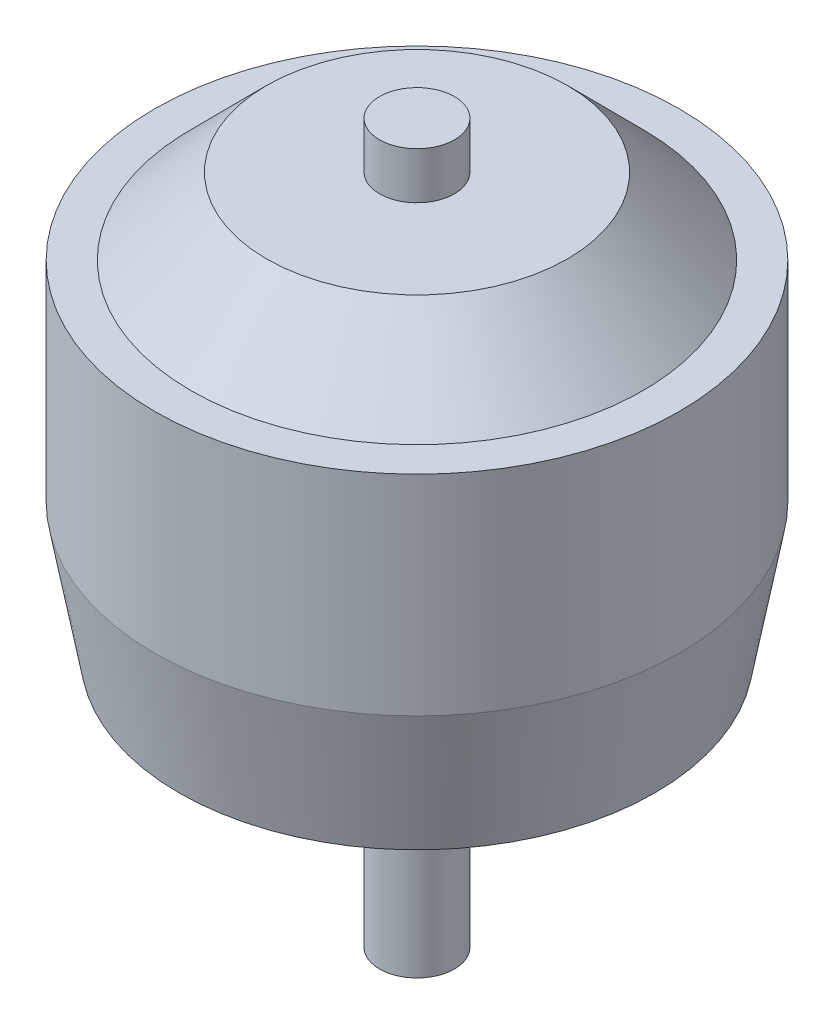
ISO-10303-21;
HEADER;
FILE_DESCRIPTION(('STEP AP214'),'2;1');
FILE_NAME('part.step','',(''),(''),'','','');
FILE_SCHEMA(('AUTOMOTIVE_DESIGN { 1 0 10303 214 1 1 1 1 }'));
ENDSEC;
DATA;
#1=APPLICATION_CONTEXT('core data for automotive mechanical design processes');
#2=APPLICATION_PROTOCOL_DEFINITION('international standard','automotive_design',2000,#1);
#3=PRODUCT_CONTEXT('',#1,'mechanical');
#4=PRODUCT('Part','Part','',(#3));
#5=PRODUCT_RELATED_PRODUCT_CATEGORY('part','',(#4));
#6=PRODUCT_DEFINITION_FORMATION('','',#4);
#7=PRODUCT_DEFINITION_CONTEXT('part definition',#1,'design');
#8=PRODUCT_DEFINITION('design','',#6,#7);
#9=PRODUCT_DEFINITION_SHAPE('','',#8);
#10=(LENGTH_UNIT() NAMED_UNIT(*) SI_UNIT(.MILLI.,.METRE.));
#11=(NAMED_UNIT(*) PLANE_ANGLE_UNIT() SI_UNIT($,.RADIAN.));
#12=(NAMED_UNIT(*) SI_UNIT($,.STERADIAN.) SOLID_ANGLE_UNIT());
#13=UNCERTAINTY_MEASURE_WITH_UNIT(LENGTH_MEASURE(1.E-05),#10,'distance_accuracy_value','');
#14=(GEOMETRIC_REPRESENTATION_CONTEXT(3) GLOBAL_UNCERTAINTY_ASSIGNED_CONTEXT((#13)) GLOBAL_UNIT_ASSIGNED_CONTEXT((#10,
#11,#12)) REPRESENTATION_CONTEXT('',''));
#15=CARTESIAN_POINT('',(0.,0.,0.));
#16=DIRECTION('',(0.,0.,1.));
#17=DIRECTION('',(1.,0.,0.));
#18=AXIS2_PLACEMENT_3D('',#15,#16,#17);
#19=CARTESIAN_POINT('',(0.,-16.8656,0.));
#20=DIRECTION('',(0.,-1.,0.));
#21=DIRECTION('',(0.,0.,-1.));
#22=AXIS2_PLACEMENT_3D('',#19,#20,#21);
#23=PLANE('',#22);
#24=CARTESIAN_POINT('',(0.,-16.8656,0.));
#25=DIRECTION('',(0.,1.,0.));
#26=DIRECTION('',(0.,0.,1.));
#27=AXIS2_PLACEMENT_3D('',#24,#25,#26);
#28=CIRCLE('',#27,2.5);
#29=CARTESIAN_POINT('',(0.,-16.8656,2.5));
#30=VERTEX_POINT('',#29);
#31=EDGE_CURVE('E10',#30,#30,#28,.T.);
#32=ORIENTED_EDGE('',*,*,#31,.F.);
#33=EDGE_LOOP('',(#32));
#34=FACE_BOUND('',#33,.T.);
#35=ADVANCED_FACE('F37',(#34),#23,.T.);
#36=CARTESIAN_POINT('',(0.,0.,0.));
#37=DIRECTION('',(0.,1.,0.));
#38=DIRECTION('',(0.,0.,1.));
#39=AXIS2_PLACEMENT_3D('',#36,#37,#38);
#40=CYLINDRICAL_SURFACE('',#39,2.5);
#41=ORIENTED_EDGE('',*,*,#31,.T.);
#42=EDGE_LOOP('',(#41));
#43=FACE_BOUND('',#42,.T.);
#44=CARTESIAN_POINT('',(0.,0.,0.));
#45=DIRECTION('',(0.,1.,0.));
#46=DIRECTION('',(0.,0.,1.));
#47=AXIS2_PLACEMENT_3D('',#44,#45,#46);
#48=CIRCLE('',#47,2.5);
#49=CARTESIAN_POINT('',(0.,0.,2.5));
#50=VERTEX_POINT('',#49);
#51=EDGE_CURVE('E43',#50,#50,#48,.T.);
#52=ORIENTED_EDGE('',*,*,#51,.F.);
#53=EDGE_LOOP('',(#52));
#54=FACE_BOUND('',#53,.T.);
#55=ADVANCED_FACE('F88',(#43,#54),#40,.T.);
#56=CARTESIAN_POINT('',(0.,0.,2.5));
#57=DIRECTION('',(0.,-1.,0.));
#58=DIRECTION('',(0.,0.,-1.));
#59=AXIS2_PLACEMENT_3D('',#56,#57,#58);
#60=PLANE('',#59);
#61=ORIENTED_EDGE('',*,*,#51,.T.);
#62=EDGE_LOOP('',(#61));
#63=FACE_BOUND('',#62,.T.);
#64=CARTESIAN_POINT('',(0.,0.,0.));
#65=DIRECTION('',(0.,1.,0.));
#66=DIRECTION('',(0.,0.,1.));
#67=AXIS2_PLACEMENT_3D('',#64,#65,#66);
#68=CIRCLE('',#67,15.875);
#69=CARTESIAN_POINT('',(0.,0.,15.875));
#70=VERTEX_POINT('',#69);
#71=EDGE_CURVE('E47',#70,#70,#68,.T.);
#72=ORIENTED_EDGE('',*,*,#71,.F.);
#73=EDGE_LOOP('',(#72));
#74=FACE_BOUND('',#73,.T.);
#75=ADVANCED_FACE('F93',(#63,#74),#60,.T.);
#76=CARTESIAN_POINT('',(0.,8.89,0.));
#77=DIRECTION('',(0.,1.,0.));
#78=DIRECTION('',(0.,0.,1.));
#79=AXIS2_PLACEMENT_3D('',#76,#77,#78);
#80=CONICAL_SURFACE('',#79,17.5006,0.180859029870879);
#81=ORIENTED_EDGE('',*,*,#71,.T.);
#82=EDGE_LOOP('',(#81));
#83=FACE_BOUND('',#82,.T.);
#84=CARTESIAN_POINT('',(0.,8.89,0.));
#85=DIRECTION('',(0.,1.,0.));
#86=DIRECTION('',(0.,0.,1.));
#87=AXIS2_PLACEMENT_3D('',#84,#85,#86);
#88=CIRCLE('',#87,17.5006);
#89=CARTESIAN_POINT('',(0.,8.89,17.5006));
#90=VERTEX_POINT('',#89);
#91=EDGE_CURVE('E51',#90,#90,#88,.T.);
#92=ORIENTED_EDGE('',*,*,#91,.F.);
#93=EDGE_LOOP('',(#92));
#94=FACE_BOUND('',#93,.T.);
#95=ADVANCED_FACE('F97',(#83,#94),#80,.T.);
#96=CARTESIAN_POINT('',(0.,0.,0.));
#97=DIRECTION('',(0.,1.,0.));
#98=DIRECTION('',(0.,0.,1.));
#99=AXIS2_PLACEMENT_3D('',#96,#97,#98);
#100=CYLINDRICAL_SURFACE('',#99,17.5006);
#101=ORIENTED_EDGE('',*,*,#91,.T.);
#102=EDGE_LOOP('',(#101));
#103=FACE_BOUND('',#102,.T.);
#104=CARTESIAN_POINT('',(0.,22.86,0.));
#105=DIRECTION('',(0.,1.,0.));
#106=DIRECTION('',(0.,0.,1.));
#107=AXIS2_PLACEMENT_3D('',#104,#105,#106);
#108=CIRCLE('',#107,17.5006);
#109=CARTESIAN_POINT('',(0.,22.86,17.5006));
#110=VERTEX_POINT('',#109);
#111=EDGE_CURVE('E56',#110,#110,#108,.T.);
#112=ORIENTED_EDGE('',*,*,#111,.F.);
#113=EDGE_LOOP('',(#112));
#114=FACE_BOUND('',#113,.T.);
#115=ADVANCED_FACE('F103',(#103,#114),#100,.T.);
#116=CARTESIAN_POINT('',(0.,22.86,17.5006));
#117=DIRECTION('',(0.,1.,0.));
#118=DIRECTION('',(0.,0.,1.));
#119=AXIS2_PLACEMENT_3D('',#116,#117,#118);
#120=PLANE('',#119);
#121=ORIENTED_EDGE('',*,*,#111,.T.);
#122=EDGE_LOOP('',(#121));
#123=FACE_BOUND('',#122,.T.);
#124=CARTESIAN_POINT('',(0.,22.86,0.));
#125=DIRECTION('',(0.,1.,0.));
#126=DIRECTION('',(0.,0.,1.));
#127=AXIS2_PLACEMENT_3D('',#124,#125,#126);
#128=CIRCLE('',#127,15.0876);
#129=CARTESIAN_POINT('',(0.,22.86,15.0876));
#130=VERTEX_POINT('',#129);
#131=EDGE_CURVE('E59',#130,#130,#128,.T.);
#132=ORIENTED_EDGE('',*,*,#131,.F.);
#133=EDGE_LOOP('',(#132));
#134=FACE_BOUND('',#133,.T.);
#135=ADVANCED_FACE('F107',(#123,#134),#120,.T.);
#136=CARTESIAN_POINT('',(0.,27.94,0.));
#137=DIRECTION('',(0.,-1.,0.));
#138=DIRECTION('',(0.,0.,-1.));
#139=AXIS2_PLACEMENT_3D('',#136,#137,#138);
#140=CONICAL_SURFACE('',#139,10.033,0.78289190298086);
#141=ORIENTED_EDGE('',*,*,#131,.T.);
#142=EDGE_LOOP('',(#141));
#143=FACE_BOUND('',#142,.T.);
#144=CARTESIAN_POINT('',(0.,27.94,0.));
#145=DIRECTION('',(0.,1.,0.));
#146=DIRECTION('',(0.,0.,1.));
#147=AXIS2_PLACEMENT_3D('',#144,#145,#146);
#148=CIRCLE('',#147,10.033);
#149=CARTESIAN_POINT('',(0.,27.94,10.033));
#150=VERTEX_POINT('',#149);
#151=EDGE_CURVE('E62',#150,#150,#148,.T.);
#152=ORIENTED_EDGE('',*,*,#151,.F.);
#153=EDGE_LOOP('',(#152));
#154=FACE_BOUND('',#153,.T.);
#155=ADVANCED_FACE('F84',(#143,#154),#140,.T.);
#156=CARTESIAN_POINT('',(0.,27.94,10.033));
#157=DIRECTION('',(0.,1.,0.));
#158=DIRECTION('',(0.,0.,1.));
#159=AXIS2_PLACEMENT_3D('',#156,#157,#158);
#160=PLANE('',#159);
#161=ORIENTED_EDGE('',*,*,#151,.T.);
#162=EDGE_LOOP('',(#161));
#163=FACE_BOUND('',#162,.T.);
#164=CARTESIAN_POINT('',(0.,27.94,0.));
#165=DIRECTION('',(0.,1.,0.));
#166=DIRECTION('',(0.,0.,1.));
#167=AXIS2_PLACEMENT_3D('',#164,#165,#166);
#168=CIRCLE('',#167,2.50000000000001);
#169=CARTESIAN_POINT('',(0.,27.94,2.50000000000001));
#170=VERTEX_POINT('',#169);
#171=EDGE_CURVE('E65',#170,#170,#168,.T.);
#172=ORIENTED_EDGE('',*,*,#171,.F.);
#173=EDGE_LOOP('',(#172));
#174=FACE_BOUND('',#173,.T.);
#175=ADVANCED_FACE('F76',(#163,#174),#160,.T.);
#176=CARTESIAN_POINT('',(0.,0.,0.));
#177=DIRECTION('',(0.,1.,0.));
#178=DIRECTION('',(0.,0.,1.));
#179=AXIS2_PLACEMENT_3D('',#176,#177,#178);
#180=CYLINDRICAL_SURFACE('',#179,2.50000000000001);
#181=ORIENTED_EDGE('',*,*,#171,.T.);
#182=EDGE_LOOP('',(#181));
#183=FACE_BOUND('',#182,.T.);
#184=CARTESIAN_POINT('',(0.,31.0642,0.));
#185=DIRECTION('',(0.,1.,0.));
#186=DIRECTION('',(0.,0.,1.));
#187=AXIS2_PLACEMENT_3D('',#184,#185,#186);
#188=CIRCLE('',#187,2.50000000000001);
#189=CARTESIAN_POINT('',(0.,31.0642,2.50000000000001));
#190=VERTEX_POINT('',#189);
#191=EDGE_CURVE('E68',#190,#190,#188,.T.);
#192=ORIENTED_EDGE('',*,*,#191,.F.);
#193=EDGE_LOOP('',(#192));
#194=FACE_BOUND('',#193,.T.);
#195=ADVANCED_FACE('F74',(#183,#194),#180,.T.);
#196=CARTESIAN_POINT('',(0.,31.0642,2.50000000000001));
#197=DIRECTION('',(0.,1.,0.));
#198=DIRECTION('',(0.,0.,1.));
#199=AXIS2_PLACEMENT_3D('',#196,#197,#198);
#200=PLANE('',#199);
#201=ORIENTED_EDGE('',*,*,#191,.T.);
#202=EDGE_LOOP('',(#201));
#203=FACE_BOUND('',#202,.T.);
#204=ADVANCED_FACE('F72',(#203),#200,.T.);
#205=CLOSED_SHELL('',(#35,#55,#75,#95,#115,#135,#155,#175,#195,#204));
#206=MANIFOLD_SOLID_BREP('B2',#205);
#207=ADVANCED_BREP_SHAPE_REPRESENTATION('',(#18,#206),#14);
#208=SHAPE_DEFINITION_REPRESENTATION(#9,#207);
ENDSEC;
END-ISO-10303-21;
